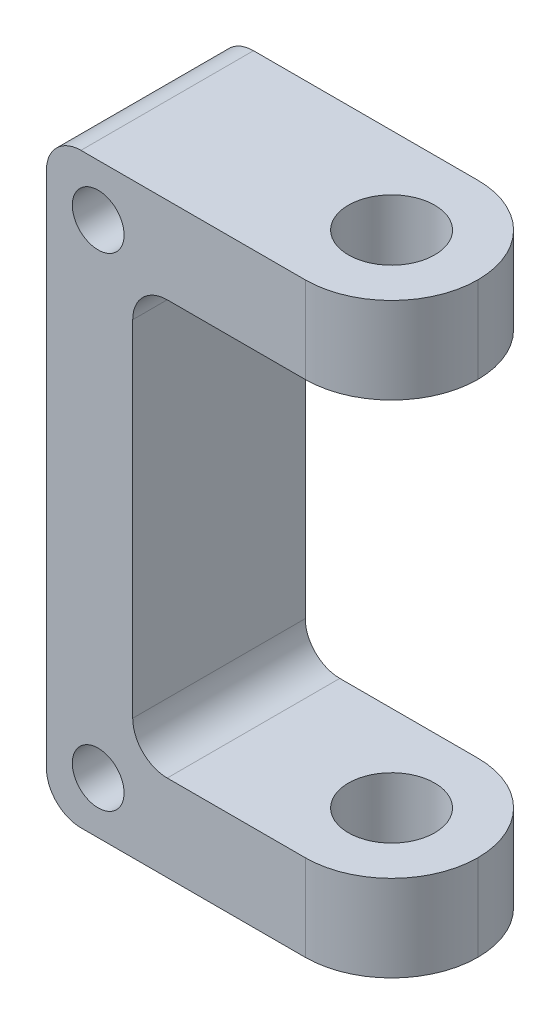
ISO-10303-21;
HEADER;
FILE_DESCRIPTION(('STEP AP214'),'2;1');
FILE_NAME('part.step','',(''),(''),'','','');
FILE_SCHEMA(('AUTOMOTIVE_DESIGN { 1 0 10303 214 1 1 1 1 }'));
ENDSEC;
DATA;
#1=APPLICATION_CONTEXT('core data for automotive mechanical design processes');
#2=APPLICATION_PROTOCOL_DEFINITION('international standard','automotive_design',2000,#1);
#3=PRODUCT_CONTEXT('',#1,'mechanical');
#4=PRODUCT('Part','Part','',(#3));
#5=PRODUCT_RELATED_PRODUCT_CATEGORY('part','',(#4));
#6=PRODUCT_DEFINITION_FORMATION('','',#4);
#7=PRODUCT_DEFINITION_CONTEXT('part definition',#1,'design');
#8=PRODUCT_DEFINITION('design','',#6,#7);
#9=PRODUCT_DEFINITION_SHAPE('','',#8);
#10=(LENGTH_UNIT() NAMED_UNIT(*) SI_UNIT(.MILLI.,.METRE.));
#11=(NAMED_UNIT(*) PLANE_ANGLE_UNIT() SI_UNIT($,.RADIAN.));
#12=(NAMED_UNIT(*) SI_UNIT($,.STERADIAN.) SOLID_ANGLE_UNIT());
#13=UNCERTAINTY_MEASURE_WITH_UNIT(LENGTH_MEASURE(1.E-05),#10,'distance_accuracy_value','');
#14=(GEOMETRIC_REPRESENTATION_CONTEXT(3) GLOBAL_UNCERTAINTY_ASSIGNED_CONTEXT((#13)) GLOBAL_UNIT_ASSIGNED_CONTEXT((#10,
#11,#12)) REPRESENTATION_CONTEXT('',''));
#15=CARTESIAN_POINT('',(0.,0.,0.));
#16=DIRECTION('',(0.,0.,1.));
#17=DIRECTION('',(1.,0.,0.));
#18=AXIS2_PLACEMENT_3D('',#15,#16,#17);
#19=CARTESIAN_POINT('',(-6.35,0.,-6.35));
#20=DIRECTION('',(1.,0.,0.));
#21=DIRECTION('',(0.,1.,0.));
#22=AXIS2_PLACEMENT_3D('',#19,#20,#21);
#23=PLANE('',#22);
#24=DIRECTION('',(0.,-1.,0.));
#25=VECTOR('',#24,1.);
#26=CARTESIAN_POINT('',(-6.35,0.,-6.35));
#27=LINE('',#26,#25);
#28=CARTESIAN_POINT('',(-6.35,12.7,-6.35));
#29=VERTEX_POINT('',#28);
#30=CARTESIAN_POINT('',(-6.35,-12.7,-6.35));
#31=VERTEX_POINT('',#30);
#32=EDGE_CURVE('E252',#29,#31,#27,.T.);
#33=ORIENTED_EDGE('',*,*,#32,.F.);
#34=DIRECTION('',(0.,0.,1.));
#35=VECTOR('',#34,1.);
#36=CARTESIAN_POINT('',(-6.35,12.7,-6.35));
#37=LINE('',#36,#35);
#38=CARTESIAN_POINT('',(-6.35,12.7,6.35));
#39=VERTEX_POINT('',#38);
#40=EDGE_CURVE('E203',#39,#29,#37,.F.);
#41=ORIENTED_EDGE('',*,*,#40,.F.);
#42=DIRECTION('',(0.,-1.,0.));
#43=VECTOR('',#42,1.);
#44=CARTESIAN_POINT('',(-6.35,0.,6.35));
#45=LINE('',#44,#43);
#46=CARTESIAN_POINT('',(-6.35,-12.7,6.35));
#47=VERTEX_POINT('',#46);
#48=EDGE_CURVE('E245',#39,#47,#45,.T.);
#49=ORIENTED_EDGE('',*,*,#48,.T.);
#50=DIRECTION('',(0.,0.,1.));
#51=VECTOR('',#50,1.);
#52=CARTESIAN_POINT('',(-6.35,-12.7,-6.35));
#53=LINE('',#52,#51);
#54=EDGE_CURVE('E210',#31,#47,#53,.T.);
#55=ORIENTED_EDGE('',*,*,#54,.F.);
#56=EDGE_LOOP('',(#33,#41,#49,#55));
#57=FACE_BOUND('',#56,.T.);
#58=ADVANCED_FACE('F39',(#57),#23,.T.);
#59=CARTESIAN_POINT('',(0.,15.24,-6.35));
#60=DIRECTION('',(0.,-1.,0.));
#61=DIRECTION('',(1.,0.,0.));
#62=AXIS2_PLACEMENT_3D('',#59,#60,#61);
#63=PLANE('',#62);
#64=CARTESIAN_POINT('',(6.34999999999999,15.24,0.));
#65=DIRECTION('',(0.,1.,0.));
#66=DIRECTION('',(1.,0.,0.));
#67=AXIS2_PLACEMENT_3D('',#64,#65,#66);
#68=CIRCLE('',#67,3.175);
#69=CARTESIAN_POINT('',(9.525,15.24,0.));
#70=VERTEX_POINT('',#69);
#71=EDGE_CURVE('E179',#70,#70,#68,.T.);
#72=ORIENTED_EDGE('',*,*,#71,.T.);
#73=EDGE_LOOP('',(#72));
#74=FACE_BOUND('',#73,.T.);
#75=DIRECTION('',(-1.,0.,0.));
#76=VECTOR('',#75,1.);
#77=CARTESIAN_POINT('',(0.,15.24,-6.35));
#78=LINE('',#77,#76);
#79=CARTESIAN_POINT('',(6.35,15.24,-6.35));
#80=VERTEX_POINT('',#79);
#81=CARTESIAN_POINT('',(-3.81,15.24,-6.35));
#82=VERTEX_POINT('',#81);
#83=EDGE_CURVE('E253',#80,#82,#78,.T.);
#84=ORIENTED_EDGE('',*,*,#83,.F.);
#85=CARTESIAN_POINT('',(6.35,15.24,0.));
#86=DIRECTION('',(0.,1.,0.));
#87=DIRECTION('',(1.,0.,0.));
#88=AXIS2_PLACEMENT_3D('',#85,#86,#87);
#89=CIRCLE('',#88,6.35);
#90=CARTESIAN_POINT('',(12.7,15.24,0.));
#91=VERTEX_POINT('',#90);
#92=EDGE_CURVE('E191',#91,#80,#89,.T.);
#93=ORIENTED_EDGE('',*,*,#92,.F.);
#94=CARTESIAN_POINT('',(6.35,15.24,0.));
#95=DIRECTION('',(0.,1.,0.));
#96=DIRECTION('',(1.,0.,0.));
#97=AXIS2_PLACEMENT_3D('',#94,#95,#96);
#98=CIRCLE('',#97,6.35);
#99=CARTESIAN_POINT('',(6.35,15.24,6.35));
#100=VERTEX_POINT('',#99);
#101=EDGE_CURVE('E194',#100,#91,#98,.T.);
#102=ORIENTED_EDGE('',*,*,#101,.F.);
#103=DIRECTION('',(-1.,0.,0.));
#104=VECTOR('',#103,1.);
#105=CARTESIAN_POINT('',(0.,15.24,6.35));
#106=LINE('',#105,#104);
#107=CARTESIAN_POINT('',(-3.81,15.24,6.35));
#108=VERTEX_POINT('',#107);
#109=EDGE_CURVE('E248',#100,#108,#106,.T.);
#110=ORIENTED_EDGE('',*,*,#109,.T.);
#111=DIRECTION('',(0.,0.,1.));
#112=VECTOR('',#111,1.);
#113=CARTESIAN_POINT('',(-3.81,15.24,6.35));
#114=LINE('',#113,#112);
#115=EDGE_CURVE('E214',#82,#108,#114,.T.);
#116=ORIENTED_EDGE('',*,*,#115,.F.);
#117=EDGE_LOOP('',(#84,#93,#102,#110,#116));
#118=FACE_BOUND('',#117,.T.);
#119=ADVANCED_FACE('F309',(#74,#118),#63,.T.);
#120=CARTESIAN_POINT('',(0.,21.59,-6.35));
#121=DIRECTION('',(0.,1.,0.));
#122=DIRECTION('',(-1.,0.,0.));
#123=AXIS2_PLACEMENT_3D('',#120,#121,#122);
#124=PLANE('',#123);
#125=CARTESIAN_POINT('',(6.34999999999999,21.59,0.));
#126=DIRECTION('',(0.,-1.,0.));
#127=DIRECTION('',(0.,0.,-1.));
#128=AXIS2_PLACEMENT_3D('',#125,#126,#127);
#129=CIRCLE('',#128,3.175);
#130=CARTESIAN_POINT('',(6.34999999999999,21.59,-3.175));
#131=VERTEX_POINT('',#130);
#132=EDGE_CURVE('E205',#131,#131,#129,.T.);
#133=ORIENTED_EDGE('',*,*,#132,.T.);
#134=EDGE_LOOP('',(#133));
#135=FACE_BOUND('',#134,.T.);
#136=DIRECTION('',(1.,0.,0.));
#137=VECTOR('',#136,1.);
#138=CARTESIAN_POINT('',(0.,21.59,6.35));
#139=LINE('',#138,#137);
#140=CARTESIAN_POINT('',(-10.16,21.59,6.35));
#141=VERTEX_POINT('',#140);
#142=CARTESIAN_POINT('',(6.35,21.59,6.35));
#143=VERTEX_POINT('',#142);
#144=EDGE_CURVE('E275',#141,#143,#139,.T.);
#145=ORIENTED_EDGE('',*,*,#144,.T.);
#146=CARTESIAN_POINT('',(6.35,21.59,0.));
#147=DIRECTION('',(0.,-1.,0.));
#148=DIRECTION('',(-1.,0.,0.));
#149=AXIS2_PLACEMENT_3D('',#146,#147,#148);
#150=CIRCLE('',#149,6.35);
#151=CARTESIAN_POINT('',(12.7,21.59,0.));
#152=VERTEX_POINT('',#151);
#153=EDGE_CURVE('E200',#152,#143,#150,.T.);
#154=ORIENTED_EDGE('',*,*,#153,.F.);
#155=CARTESIAN_POINT('',(6.35,21.59,0.));
#156=DIRECTION('',(0.,-1.,0.));
#157=DIRECTION('',(-1.,0.,0.));
#158=AXIS2_PLACEMENT_3D('',#155,#156,#157);
#159=CIRCLE('',#158,6.35);
#160=CARTESIAN_POINT('',(6.35,21.59,-6.35));
#161=VERTEX_POINT('',#160);
#162=EDGE_CURVE('E197',#161,#152,#159,.T.);
#163=ORIENTED_EDGE('',*,*,#162,.F.);
#164=DIRECTION('',(1.,0.,0.));
#165=VECTOR('',#164,1.);
#166=CARTESIAN_POINT('',(0.,21.59,-6.35));
#167=LINE('',#166,#165);
#168=CARTESIAN_POINT('',(-10.16,21.59,-6.35));
#169=VERTEX_POINT('',#168);
#170=EDGE_CURVE('E256',#169,#161,#167,.T.);
#171=ORIENTED_EDGE('',*,*,#170,.F.);
#172=DIRECTION('',(0.,0.,1.));
#173=VECTOR('',#172,1.);
#174=CARTESIAN_POINT('',(-10.16,21.59,-6.35));
#175=LINE('',#174,#173);
#176=EDGE_CURVE('E231',#141,#169,#175,.F.);
#177=ORIENTED_EDGE('',*,*,#176,.F.);
#178=EDGE_LOOP('',(#145,#154,#163,#171,#177));
#179=FACE_BOUND('',#178,.T.);
#180=ADVANCED_FACE('F314',(#135,#179),#124,.T.);
#181=CARTESIAN_POINT('',(-12.7,0.,-6.35));
#182=DIRECTION('',(1.,0.,0.));
#183=DIRECTION('',(0.,1.,0.));
#184=AXIS2_PLACEMENT_3D('',#181,#182,#183);
#185=PLANE('',#184);
#186=DIRECTION('',(0.,-1.,0.));
#187=VECTOR('',#186,1.);
#188=CARTESIAN_POINT('',(-12.7,0.,6.35));
#189=LINE('',#188,#187);
#190=CARTESIAN_POINT('',(-12.7,19.05,6.35));
#191=VERTEX_POINT('',#190);
#192=CARTESIAN_POINT('',(-12.7,-19.05,6.35));
#193=VERTEX_POINT('',#192);
#194=EDGE_CURVE('E172',#191,#193,#189,.T.);
#195=ORIENTED_EDGE('',*,*,#194,.F.);
#196=DIRECTION('',(0.,0.,1.));
#197=VECTOR('',#196,1.);
#198=CARTESIAN_POINT('',(-12.7,19.05,6.35));
#199=LINE('',#198,#197);
#200=CARTESIAN_POINT('',(-12.7,19.05,-6.35));
#201=VERTEX_POINT('',#200);
#202=EDGE_CURVE('E224',#201,#191,#199,.T.);
#203=ORIENTED_EDGE('',*,*,#202,.F.);
#204=DIRECTION('',(0.,-1.,0.));
#205=VECTOR('',#204,1.);
#206=CARTESIAN_POINT('',(-12.7,0.,-6.35));
#207=LINE('',#206,#205);
#208=CARTESIAN_POINT('',(-12.7,-19.05,-6.35));
#209=VERTEX_POINT('',#208);
#210=EDGE_CURVE('E262',#201,#209,#207,.T.);
#211=ORIENTED_EDGE('',*,*,#210,.T.);
#212=DIRECTION('',(0.,0.,1.));
#213=VECTOR('',#212,1.);
#214=CARTESIAN_POINT('',(-12.7,-19.05,-6.35));
#215=LINE('',#214,#213);
#216=EDGE_CURVE('E227',#193,#209,#215,.F.);
#217=ORIENTED_EDGE('',*,*,#216,.F.);
#218=EDGE_LOOP('',(#195,#203,#211,#217));
#219=FACE_BOUND('',#218,.T.);
#220=ADVANCED_FACE('F283',(#219),#185,.F.);
#221=CARTESIAN_POINT('',(0.,-21.59,-6.35));
#222=DIRECTION('',(0.,1.,0.));
#223=DIRECTION('',(0.,0.,-1.));
#224=AXIS2_PLACEMENT_3D('',#221,#222,#223);
#225=PLANE('',#224);
#226=CARTESIAN_POINT('',(6.34999999999999,-21.59,0.));
#227=DIRECTION('',(0.,-1.,0.));
#228=DIRECTION('',(0.,0.,-1.));
#229=AXIS2_PLACEMENT_3D('',#226,#227,#228);
#230=CIRCLE('',#229,3.175);
#231=CARTESIAN_POINT('',(6.34999999999999,-21.59,-3.175));
#232=VERTEX_POINT('',#231);
#233=EDGE_CURVE('E180',#232,#232,#230,.T.);
#234=ORIENTED_EDGE('',*,*,#233,.F.);
#235=EDGE_LOOP('',(#234));
#236=FACE_BOUND('',#235,.T.);
#237=DIRECTION('',(1.,0.,0.));
#238=VECTOR('',#237,1.);
#239=CARTESIAN_POINT('',(0.,-21.59,-6.35));
#240=LINE('',#239,#238);
#241=CARTESIAN_POINT('',(-10.16,-21.59,-6.35));
#242=VERTEX_POINT('',#241);
#243=CARTESIAN_POINT('',(6.35,-21.59,-6.35));
#244=VERTEX_POINT('',#243);
#245=EDGE_CURVE('E265',#242,#244,#240,.T.);
#246=ORIENTED_EDGE('',*,*,#245,.T.);
#247=CARTESIAN_POINT('',(6.35,-21.59,0.));
#248=DIRECTION('',(0.,-1.,0.));
#249=DIRECTION('',(0.,0.,-1.));
#250=AXIS2_PLACEMENT_3D('',#247,#248,#249);
#251=CIRCLE('',#250,6.35);
#252=CARTESIAN_POINT('',(12.7,-21.59,0.));
#253=VERTEX_POINT('',#252);
#254=EDGE_CURVE('E149',#253,#244,#251,.F.);
#255=ORIENTED_EDGE('',*,*,#254,.F.);
#256=CARTESIAN_POINT('',(6.35,-21.59,0.));
#257=DIRECTION('',(0.,-1.,0.));
#258=DIRECTION('',(0.,0.,-1.));
#259=AXIS2_PLACEMENT_3D('',#256,#257,#258);
#260=CIRCLE('',#259,6.35);
#261=CARTESIAN_POINT('',(6.35,-21.59,6.35));
#262=VERTEX_POINT('',#261);
#263=EDGE_CURVE('E185',#262,#253,#260,.F.);
#264=ORIENTED_EDGE('',*,*,#263,.F.);
#265=DIRECTION('',(1.,0.,0.));
#266=VECTOR('',#265,1.);
#267=CARTESIAN_POINT('',(0.,-21.59,6.35));
#268=LINE('',#267,#266);
#269=CARTESIAN_POINT('',(-10.16,-21.59,6.35));
#270=VERTEX_POINT('',#269);
#271=EDGE_CURVE('E145',#270,#262,#268,.T.);
#272=ORIENTED_EDGE('',*,*,#271,.F.);
#273=DIRECTION('',(0.,0.,1.));
#274=VECTOR('',#273,1.);
#275=CARTESIAN_POINT('',(-10.16,-21.59,-6.35));
#276=LINE('',#275,#274);
#277=EDGE_CURVE('E217',#242,#270,#276,.T.);
#278=ORIENTED_EDGE('',*,*,#277,.F.);
#279=EDGE_LOOP('',(#246,#255,#264,#272,#278));
#280=FACE_BOUND('',#279,.T.);
#281=ADVANCED_FACE('F288',(#236,#280),#225,.F.);
#282=CARTESIAN_POINT('',(-8.89,17.78,-6.35));
#283=DIRECTION('',(0.,0.,1.));
#284=DIRECTION('',(-1.,0.,0.));
#285=AXIS2_PLACEMENT_3D('',#282,#283,#284);
#286=CYLINDRICAL_SURFACE('',#285,1.905);
#287=CARTESIAN_POINT('',(-8.89,17.78,-6.35));
#288=DIRECTION('',(0.,0.,1.));
#289=DIRECTION('',(1.,0.,0.));
#290=AXIS2_PLACEMENT_3D('',#287,#288,#289);
#291=CIRCLE('',#290,1.905);
#292=CARTESIAN_POINT('',(-6.985,17.78,-6.35));
#293=VERTEX_POINT('',#292);
#294=EDGE_CURVE('E170',#293,#293,#291,.T.);
#295=ORIENTED_EDGE('',*,*,#294,.F.);
#296=EDGE_LOOP('',(#295));
#297=FACE_BOUND('',#296,.T.);
#298=CARTESIAN_POINT('',(-8.89,17.78,6.35));
#299=DIRECTION('',(0.,0.,1.));
#300=DIRECTION('',(1.,0.,0.));
#301=AXIS2_PLACEMENT_3D('',#298,#299,#300);
#302=CIRCLE('',#301,1.905);
#303=CARTESIAN_POINT('',(-6.985,17.78,6.35));
#304=VERTEX_POINT('',#303);
#305=EDGE_CURVE('E249',#304,#304,#302,.T.);
#306=ORIENTED_EDGE('',*,*,#305,.T.);
#307=EDGE_LOOP('',(#306));
#308=FACE_BOUND('',#307,.T.);
#309=ADVANCED_FACE('F319',(#297,#308),#286,.F.);
#310=CARTESIAN_POINT('',(-8.89,-17.78,-6.35));
#311=DIRECTION('',(0.,0.,1.));
#312=DIRECTION('',(-1.,0.,0.));
#313=AXIS2_PLACEMENT_3D('',#310,#311,#312);
#314=CYLINDRICAL_SURFACE('',#313,1.905);
#315=CARTESIAN_POINT('',(-8.89,-17.78,-6.35));
#316=DIRECTION('',(0.,0.,1.));
#317=DIRECTION('',(1.,0.,0.));
#318=AXIS2_PLACEMENT_3D('',#315,#316,#317);
#319=CIRCLE('',#318,1.905);
#320=CARTESIAN_POINT('',(-6.985,-17.78,-6.35));
#321=VERTEX_POINT('',#320);
#322=EDGE_CURVE('E167',#321,#321,#319,.T.);
#323=ORIENTED_EDGE('',*,*,#322,.F.);
#324=EDGE_LOOP('',(#323));
#325=FACE_BOUND('',#324,.T.);
#326=CARTESIAN_POINT('',(-8.89,-17.78,6.35));
#327=DIRECTION('',(0.,0.,1.));
#328=DIRECTION('',(1.,0.,0.));
#329=AXIS2_PLACEMENT_3D('',#326,#327,#328);
#330=CIRCLE('',#329,1.905);
#331=CARTESIAN_POINT('',(-6.985,-17.78,6.35));
#332=VERTEX_POINT('',#331);
#333=EDGE_CURVE('E269',#332,#332,#330,.T.);
#334=ORIENTED_EDGE('',*,*,#333,.T.);
#335=EDGE_LOOP('',(#334));
#336=FACE_BOUND('',#335,.T.);
#337=ADVANCED_FACE('F322',(#325,#336),#314,.F.);
#338=CARTESIAN_POINT('',(0.,-15.24,-6.35));
#339=DIRECTION('',(0.,-1.,0.));
#340=DIRECTION('',(1.,0.,0.));
#341=AXIS2_PLACEMENT_3D('',#338,#339,#340);
#342=PLANE('',#341);
#343=CARTESIAN_POINT('',(6.34999999999999,-15.24,0.));
#344=DIRECTION('',(0.,1.,0.));
#345=DIRECTION('',(1.,0.,0.));
#346=AXIS2_PLACEMENT_3D('',#343,#344,#345);
#347=CIRCLE('',#346,3.175);
#348=CARTESIAN_POINT('',(9.525,-15.24,0.));
#349=VERTEX_POINT('',#348);
#350=EDGE_CURVE('E176',#349,#349,#347,.T.);
#351=ORIENTED_EDGE('',*,*,#350,.F.);
#352=EDGE_LOOP('',(#351));
#353=FACE_BOUND('',#352,.T.);
#354=DIRECTION('',(-1.,0.,0.));
#355=VECTOR('',#354,1.);
#356=CARTESIAN_POINT('',(0.,-15.24,6.35));
#357=LINE('',#356,#355);
#358=CARTESIAN_POINT('',(6.35,-15.24,6.35));
#359=VERTEX_POINT('',#358);
#360=CARTESIAN_POINT('',(-3.81,-15.24,6.35));
#361=VERTEX_POINT('',#360);
#362=EDGE_CURVE('E143',#359,#361,#357,.T.);
#363=ORIENTED_EDGE('',*,*,#362,.F.);
#364=CARTESIAN_POINT('',(6.35,-15.24,0.));
#365=DIRECTION('',(0.,1.,0.));
#366=DIRECTION('',(1.,0.,0.));
#367=AXIS2_PLACEMENT_3D('',#364,#365,#366);
#368=CIRCLE('',#367,6.35);
#369=CARTESIAN_POINT('',(12.7,-15.24,0.));
#370=VERTEX_POINT('',#369);
#371=EDGE_CURVE('E153',#370,#359,#368,.F.);
#372=ORIENTED_EDGE('',*,*,#371,.F.);
#373=CARTESIAN_POINT('',(6.35,-15.24,0.));
#374=DIRECTION('',(0.,1.,0.));
#375=DIRECTION('',(1.,0.,0.));
#376=AXIS2_PLACEMENT_3D('',#373,#374,#375);
#377=CIRCLE('',#376,6.35);
#378=CARTESIAN_POINT('',(6.35,-15.24,-6.35));
#379=VERTEX_POINT('',#378);
#380=EDGE_CURVE('E160',#379,#370,#377,.F.);
#381=ORIENTED_EDGE('',*,*,#380,.F.);
#382=DIRECTION('',(-1.,0.,0.));
#383=VECTOR('',#382,1.);
#384=CARTESIAN_POINT('',(0.,-15.24,-6.35));
#385=LINE('',#384,#383);
#386=CARTESIAN_POINT('',(-3.81,-15.24,-6.35));
#387=VERTEX_POINT('',#386);
#388=EDGE_CURVE('E181',#379,#387,#385,.T.);
#389=ORIENTED_EDGE('',*,*,#388,.T.);
#390=DIRECTION('',(0.,0.,1.));
#391=VECTOR('',#390,1.);
#392=CARTESIAN_POINT('',(-3.81,-15.24,-6.35));
#393=LINE('',#392,#391);
#394=EDGE_CURVE('E166',#361,#387,#393,.F.);
#395=ORIENTED_EDGE('',*,*,#394,.F.);
#396=EDGE_LOOP('',(#363,#372,#381,#389,#395));
#397=FACE_BOUND('',#396,.T.);
#398=ADVANCED_FACE('F163',(#353,#397),#342,.F.);
#399=CARTESIAN_POINT('',(0.,0.,-6.35));
#400=DIRECTION('',(0.,0.,-1.));
#401=DIRECTION('',(1.,0.,0.));
#402=AXIS2_PLACEMENT_3D('',#399,#400,#401);
#403=PLANE('',#402);
#404=ORIENTED_EDGE('',*,*,#322,.T.);
#405=EDGE_LOOP('',(#404));
#406=FACE_BOUND('',#405,.T.);
#407=ORIENTED_EDGE('',*,*,#294,.T.);
#408=EDGE_LOOP('',(#407));
#409=FACE_BOUND('',#408,.T.);
#410=ORIENTED_EDGE('',*,*,#210,.F.);
#411=CARTESIAN_POINT('',(-10.16,19.05,-6.35));
#412=DIRECTION('',(0.,0.,1.));
#413=DIRECTION('',(1.,0.,0.));
#414=AXIS2_PLACEMENT_3D('',#411,#412,#413);
#415=CIRCLE('',#414,2.54);
#416=EDGE_CURVE('E54',#169,#201,#415,.T.);
#417=ORIENTED_EDGE('',*,*,#416,.F.);
#418=ORIENTED_EDGE('',*,*,#170,.T.);
#419=DIRECTION('',(0.,-1.,0.));
#420=VECTOR('',#419,1.);
#421=CARTESIAN_POINT('',(6.35,0.,-6.35));
#422=LINE('',#421,#420);
#423=EDGE_CURVE('E159',#80,#161,#422,.F.);
#424=ORIENTED_EDGE('',*,*,#423,.F.);
#425=ORIENTED_EDGE('',*,*,#83,.T.);
#426=CARTESIAN_POINT('',(-3.81,12.7,-6.35));
#427=DIRECTION('',(0.,0.,1.));
#428=DIRECTION('',(1.,0.,0.));
#429=AXIS2_PLACEMENT_3D('',#426,#427,#428);
#430=CIRCLE('',#429,2.54);
#431=EDGE_CURVE('E11',#29,#82,#430,.F.);
#432=ORIENTED_EDGE('',*,*,#431,.F.);
#433=ORIENTED_EDGE('',*,*,#32,.T.);
#434=CARTESIAN_POINT('',(-3.81,-12.7,-6.35));
#435=DIRECTION('',(0.,0.,1.));
#436=DIRECTION('',(1.,0.,0.));
#437=AXIS2_PLACEMENT_3D('',#434,#435,#436);
#438=CIRCLE('',#437,2.54);
#439=EDGE_CURVE('E235',#387,#31,#438,.F.);
#440=ORIENTED_EDGE('',*,*,#439,.F.);
#441=ORIENTED_EDGE('',*,*,#388,.F.);
#442=DIRECTION('',(0.,-1.,0.));
#443=VECTOR('',#442,1.);
#444=CARTESIAN_POINT('',(6.35,0.,-6.35));
#445=LINE('',#444,#443);
#446=EDGE_CURVE('E189',#244,#379,#445,.F.);
#447=ORIENTED_EDGE('',*,*,#446,.F.);
#448=ORIENTED_EDGE('',*,*,#245,.F.);
#449=CARTESIAN_POINT('',(-10.16,-19.05,-6.35));
#450=DIRECTION('',(0.,0.,1.));
#451=DIRECTION('',(1.,0.,0.));
#452=AXIS2_PLACEMENT_3D('',#449,#450,#451);
#453=CIRCLE('',#452,2.54);
#454=EDGE_CURVE('E60',#209,#242,#453,.T.);
#455=ORIENTED_EDGE('',*,*,#454,.F.);
#456=EDGE_LOOP('',(#410,#417,#418,#424,#425,#432,#433,#440,#441,#447,#448,#455));
#457=FACE_BOUND('',#456,.T.);
#458=ADVANCED_FACE('F293',(#406,#409,#457),#403,.T.);
#459=CARTESIAN_POINT('',(0.,0.,6.35));
#460=DIRECTION('',(0.,0.,-1.));
#461=DIRECTION('',(1.,0.,0.));
#462=AXIS2_PLACEMENT_3D('',#459,#460,#461);
#463=PLANE('',#462);
#464=ORIENTED_EDGE('',*,*,#333,.F.);
#465=EDGE_LOOP('',(#464));
#466=FACE_BOUND('',#465,.T.);
#467=ORIENTED_EDGE('',*,*,#305,.F.);
#468=EDGE_LOOP('',(#467));
#469=FACE_BOUND('',#468,.T.);
#470=ORIENTED_EDGE('',*,*,#271,.T.);
#471=DIRECTION('',(0.,-1.,0.));
#472=VECTOR('',#471,1.);
#473=CARTESIAN_POINT('',(6.35,-21.59,6.35));
#474=LINE('',#473,#472);
#475=EDGE_CURVE('E139',#359,#262,#474,.T.);
#476=ORIENTED_EDGE('',*,*,#475,.F.);
#477=ORIENTED_EDGE('',*,*,#362,.T.);
#478=CARTESIAN_POINT('',(-3.81,-12.7,6.35));
#479=DIRECTION('',(0.,0.,1.));
#480=DIRECTION('',(1.,0.,0.));
#481=AXIS2_PLACEMENT_3D('',#478,#479,#480);
#482=CIRCLE('',#481,2.54);
#483=EDGE_CURVE('E233',#47,#361,#482,.T.);
#484=ORIENTED_EDGE('',*,*,#483,.F.);
#485=ORIENTED_EDGE('',*,*,#48,.F.);
#486=CARTESIAN_POINT('',(-3.81,12.7,6.35));
#487=DIRECTION('',(0.,0.,1.));
#488=DIRECTION('',(1.,0.,0.));
#489=AXIS2_PLACEMENT_3D('',#486,#487,#488);
#490=CIRCLE('',#489,2.54);
#491=EDGE_CURVE('E47',#108,#39,#490,.T.);
#492=ORIENTED_EDGE('',*,*,#491,.F.);
#493=ORIENTED_EDGE('',*,*,#109,.F.);
#494=DIRECTION('',(0.,-1.,0.));
#495=VECTOR('',#494,1.);
#496=CARTESIAN_POINT('',(6.35,15.24,6.35));
#497=LINE('',#496,#495);
#498=EDGE_CURVE('E150',#143,#100,#497,.T.);
#499=ORIENTED_EDGE('',*,*,#498,.F.);
#500=ORIENTED_EDGE('',*,*,#144,.F.);
#501=CARTESIAN_POINT('',(-10.16,19.05,6.35));
#502=DIRECTION('',(0.,0.,1.));
#503=DIRECTION('',(1.,0.,0.));
#504=AXIS2_PLACEMENT_3D('',#501,#502,#503);
#505=CIRCLE('',#504,2.54);
#506=EDGE_CURVE('E220',#191,#141,#505,.F.);
#507=ORIENTED_EDGE('',*,*,#506,.F.);
#508=ORIENTED_EDGE('',*,*,#194,.T.);
#509=CARTESIAN_POINT('',(-10.16,-19.05,6.35));
#510=DIRECTION('',(0.,0.,1.));
#511=DIRECTION('',(1.,0.,0.));
#512=AXIS2_PLACEMENT_3D('',#509,#510,#511);
#513=CIRCLE('',#512,2.54);
#514=EDGE_CURVE('E222',#270,#193,#513,.F.);
#515=ORIENTED_EDGE('',*,*,#514,.F.);
#516=EDGE_LOOP('',(#470,#476,#477,#484,#485,#492,#493,#499,#500,#507,#508,#515));
#517=FACE_BOUND('',#516,.T.);
#518=ADVANCED_FACE('F141',(#466,#469,#517),#463,.F.);
#519=CARTESIAN_POINT('',(6.34999999999999,-21.59,0.));
#520=DIRECTION('',(0.,1.,0.));
#521=DIRECTION('',(0.,0.,-1.));
#522=AXIS2_PLACEMENT_3D('',#519,#520,#521);
#523=CYLINDRICAL_SURFACE('',#522,3.175);
#524=ORIENTED_EDGE('',*,*,#233,.T.);
#525=EDGE_LOOP('',(#524));
#526=FACE_BOUND('',#525,.T.);
#527=ORIENTED_EDGE('',*,*,#350,.T.);
#528=EDGE_LOOP('',(#527));
#529=FACE_BOUND('',#528,.T.);
#530=ADVANCED_FACE('F390',(#526,#529),#523,.F.);
#531=ORIENTED_EDGE('',*,*,#71,.F.);
#532=EDGE_LOOP('',(#531));
#533=FACE_BOUND('',#532,.T.);
#534=ORIENTED_EDGE('',*,*,#132,.F.);
#535=EDGE_LOOP('',(#534));
#536=FACE_BOUND('',#535,.T.);
#537=ADVANCED_FACE('F330',(#533,#536),#523,.F.);
#538=CARTESIAN_POINT('',(6.35,0.,0.));
#539=DIRECTION('',(0.,-1.,0.));
#540=DIRECTION('',(1.,0.,0.));
#541=AXIS2_PLACEMENT_3D('',#538,#539,#540);
#542=CYLINDRICAL_SURFACE('',#541,6.35);
#543=DIRECTION('',(0.,-1.,0.));
#544=VECTOR('',#543,1.);
#545=CARTESIAN_POINT('',(12.7,0.,0.));
#546=LINE('',#545,#544);
#547=EDGE_CURVE('E155',#370,#253,#546,.T.);
#548=ORIENTED_EDGE('',*,*,#547,.T.);
#549=ORIENTED_EDGE('',*,*,#254,.T.);
#550=ORIENTED_EDGE('',*,*,#446,.T.);
#551=ORIENTED_EDGE('',*,*,#380,.T.);
#552=EDGE_LOOP('',(#548,#549,#550,#551));
#553=FACE_BOUND('',#552,.T.);
#554=ADVANCED_FACE('F291',(#553),#542,.T.);
#555=CARTESIAN_POINT('',(6.35,0.,0.));
#556=DIRECTION('',(0.,1.,0.));
#557=DIRECTION('',(-1.,0.,0.));
#558=AXIS2_PLACEMENT_3D('',#555,#556,#557);
#559=CYLINDRICAL_SURFACE('',#558,6.35);
#560=ORIENTED_EDGE('',*,*,#371,.T.);
#561=ORIENTED_EDGE('',*,*,#475,.T.);
#562=ORIENTED_EDGE('',*,*,#263,.T.);
#563=ORIENTED_EDGE('',*,*,#547,.F.);
#564=EDGE_LOOP('',(#560,#561,#562,#563));
#565=FACE_BOUND('',#564,.T.);
#566=ADVANCED_FACE('F154',(#565),#559,.T.);
#567=CARTESIAN_POINT('',(6.35,0.,0.));
#568=DIRECTION('',(0.,-1.,0.));
#569=DIRECTION('',(1.,0.,0.));
#570=AXIS2_PLACEMENT_3D('',#567,#568,#569);
#571=CYLINDRICAL_SURFACE('',#570,6.35);
#572=DIRECTION('',(0.,-1.,0.));
#573=VECTOR('',#572,1.);
#574=CARTESIAN_POINT('',(12.7,0.,0.));
#575=LINE('',#574,#573);
#576=EDGE_CURVE('E206',#152,#91,#575,.T.);
#577=ORIENTED_EDGE('',*,*,#576,.T.);
#578=ORIENTED_EDGE('',*,*,#92,.T.);
#579=ORIENTED_EDGE('',*,*,#423,.T.);
#580=ORIENTED_EDGE('',*,*,#162,.T.);
#581=EDGE_LOOP('',(#577,#578,#579,#580));
#582=FACE_BOUND('',#581,.T.);
#583=ADVANCED_FACE('F304',(#582),#571,.T.);
#584=CARTESIAN_POINT('',(6.35,0.,0.));
#585=DIRECTION('',(0.,1.,0.));
#586=DIRECTION('',(-1.,0.,0.));
#587=AXIS2_PLACEMENT_3D('',#584,#585,#586);
#588=CYLINDRICAL_SURFACE('',#587,6.35);
#589=ORIENTED_EDGE('',*,*,#153,.T.);
#590=ORIENTED_EDGE('',*,*,#498,.T.);
#591=ORIENTED_EDGE('',*,*,#101,.T.);
#592=ORIENTED_EDGE('',*,*,#576,.F.);
#593=EDGE_LOOP('',(#589,#590,#591,#592));
#594=FACE_BOUND('',#593,.T.);
#595=ADVANCED_FACE('F297',(#594),#588,.T.);
#596=CARTESIAN_POINT('',(-3.81,-12.7,-6.35));
#597=DIRECTION('',(0.,0.,1.));
#598=DIRECTION('',(-1.,0.,0.));
#599=AXIS2_PLACEMENT_3D('',#596,#597,#598);
#600=CYLINDRICAL_SURFACE('',#599,2.54);
#601=ORIENTED_EDGE('',*,*,#439,.T.);
#602=ORIENTED_EDGE('',*,*,#54,.T.);
#603=ORIENTED_EDGE('',*,*,#483,.T.);
#604=ORIENTED_EDGE('',*,*,#394,.T.);
#605=EDGE_LOOP('',(#601,#602,#603,#604));
#606=FACE_BOUND('',#605,.T.);
#607=ADVANCED_FACE('F295',(#606),#600,.F.);
#608=CARTESIAN_POINT('',(-3.81,12.7,-6.35));
#609=DIRECTION('',(0.,0.,-1.));
#610=DIRECTION('',(1.,0.,0.));
#611=AXIS2_PLACEMENT_3D('',#608,#609,#610);
#612=CYLINDRICAL_SURFACE('',#611,2.54);
#613=ORIENTED_EDGE('',*,*,#431,.T.);
#614=ORIENTED_EDGE('',*,*,#115,.T.);
#615=ORIENTED_EDGE('',*,*,#491,.T.);
#616=ORIENTED_EDGE('',*,*,#40,.T.);
#617=EDGE_LOOP('',(#613,#614,#615,#616));
#618=FACE_BOUND('',#617,.T.);
#619=ADVANCED_FACE('F238',(#618),#612,.F.);
#620=CARTESIAN_POINT('',(-10.16,-19.05,-6.35));
#621=DIRECTION('',(0.,0.,1.));
#622=DIRECTION('',(-1.,0.,0.));
#623=AXIS2_PLACEMENT_3D('',#620,#621,#622);
#624=CYLINDRICAL_SURFACE('',#623,2.54);
#625=ORIENTED_EDGE('',*,*,#454,.T.);
#626=ORIENTED_EDGE('',*,*,#277,.T.);
#627=ORIENTED_EDGE('',*,*,#514,.T.);
#628=ORIENTED_EDGE('',*,*,#216,.T.);
#629=EDGE_LOOP('',(#625,#626,#627,#628));
#630=FACE_BOUND('',#629,.T.);
#631=ADVANCED_FACE('F285',(#630),#624,.T.);
#632=CARTESIAN_POINT('',(-10.16,19.05,-6.35));
#633=DIRECTION('',(0.,0.,-1.));
#634=DIRECTION('',(1.,0.,0.));
#635=AXIS2_PLACEMENT_3D('',#632,#633,#634);
#636=CYLINDRICAL_SURFACE('',#635,2.54);
#637=ORIENTED_EDGE('',*,*,#416,.T.);
#638=ORIENTED_EDGE('',*,*,#202,.T.);
#639=ORIENTED_EDGE('',*,*,#506,.T.);
#640=ORIENTED_EDGE('',*,*,#176,.T.);
#641=EDGE_LOOP('',(#637,#638,#639,#640));
#642=FACE_BOUND('',#641,.T.);
#643=ADVANCED_FACE('F41',(#642),#636,.T.);
#644=CLOSED_SHELL('',(#58,#119,#180,#220,#281,#309,#337,#398,#458,#518,#530,#537,#554,#566,#583,
#595,#607,#619,#631,#643));
#645=MANIFOLD_SOLID_BREP('B2',#644);
#646=ADVANCED_BREP_SHAPE_REPRESENTATION('',(#18,#645),#14);
#647=SHAPE_DEFINITION_REPRESENTATION(#9,#646);
ENDSEC;
END-ISO-10303-21;
